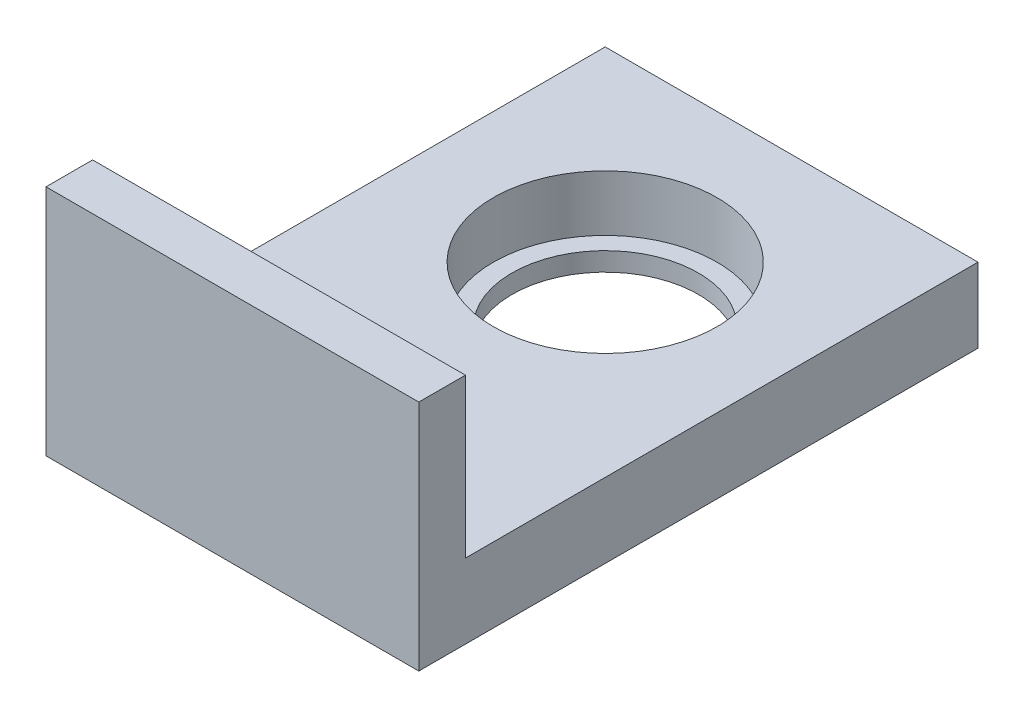
ISO-10303-21;
HEADER;
FILE_DESCRIPTION(('STEP AP214'),'2;1');
FILE_NAME('part.step','',(''),(''),'','','');
FILE_SCHEMA(('AUTOMOTIVE_DESIGN { 1 0 10303 214 1 1 1 1 }'));
ENDSEC;
DATA;
#1=APPLICATION_CONTEXT('core data for automotive mechanical design processes');
#2=APPLICATION_PROTOCOL_DEFINITION('international standard','automotive_design',2000,#1);
#3=PRODUCT_CONTEXT('',#1,'mechanical');
#4=PRODUCT('Part','Part','',(#3));
#5=PRODUCT_RELATED_PRODUCT_CATEGORY('part','',(#4));
#6=PRODUCT_DEFINITION_FORMATION('','',#4);
#7=PRODUCT_DEFINITION_CONTEXT('part definition',#1,'design');
#8=PRODUCT_DEFINITION('design','',#6,#7);
#9=PRODUCT_DEFINITION_SHAPE('','',#8);
#10=(LENGTH_UNIT() NAMED_UNIT(*) SI_UNIT(.MILLI.,.METRE.));
#11=(NAMED_UNIT(*) PLANE_ANGLE_UNIT() SI_UNIT($,.RADIAN.));
#12=(NAMED_UNIT(*) SI_UNIT($,.STERADIAN.) SOLID_ANGLE_UNIT());
#13=UNCERTAINTY_MEASURE_WITH_UNIT(LENGTH_MEASURE(1.E-05),#10,'distance_accuracy_value','');
#14=(GEOMETRIC_REPRESENTATION_CONTEXT(3) GLOBAL_UNCERTAINTY_ASSIGNED_CONTEXT((#13)) GLOBAL_UNIT_ASSIGNED_CONTEXT((#10,
#11,#12)) REPRESENTATION_CONTEXT('',''));
#15=CARTESIAN_POINT('',(0.,0.,0.));
#16=DIRECTION('',(0.,0.,1.));
#17=DIRECTION('',(1.,0.,0.));
#18=AXIS2_PLACEMENT_3D('',#15,#16,#17);
#19=CARTESIAN_POINT('',(40.,8.,0.));
#20=DIRECTION('',(-1.,0.,0.));
#21=DIRECTION('',(0.,0.,1.));
#22=AXIS2_PLACEMENT_3D('',#19,#20,#21);
#23=PLANE('',#22);
#24=DIRECTION('',(0.,0.,-1.));
#25=VECTOR('',#24,1.);
#26=CARTESIAN_POINT('',(40.,0.,0.));
#27=LINE('',#26,#25);
#28=CARTESIAN_POINT('',(40.,0.,5.));
#29=VERTEX_POINT('',#28);
#30=CARTESIAN_POINT('',(40.,0.,-55.));
#31=VERTEX_POINT('',#30);
#32=EDGE_CURVE('E86',#29,#31,#27,.T.);
#33=ORIENTED_EDGE('',*,*,#32,.T.);
#34=DIRECTION('',(0.,-1.,0.));
#35=VECTOR('',#34,1.);
#36=CARTESIAN_POINT('',(40.,8.,-55.));
#37=LINE('',#36,#35);
#38=CARTESIAN_POINT('',(40.,8.,-55.));
#39=VERTEX_POINT('',#38);
#40=EDGE_CURVE('E11',#39,#31,#37,.T.);
#41=ORIENTED_EDGE('',*,*,#40,.F.);
#42=DIRECTION('',(0.,0.,-1.));
#43=VECTOR('',#42,1.);
#44=CARTESIAN_POINT('',(40.,8.,0.));
#45=LINE('',#44,#43);
#46=CARTESIAN_POINT('',(40.,8.,0.));
#47=VERTEX_POINT('',#46);
#48=EDGE_CURVE('E89',#47,#39,#45,.T.);
#49=ORIENTED_EDGE('',*,*,#48,.F.);
#50=DIRECTION('',(0.,-1.,0.));
#51=VECTOR('',#50,1.);
#52=CARTESIAN_POINT('',(40.,25.,0.));
#53=LINE('',#52,#51);
#54=CARTESIAN_POINT('',(40.,25.,0.));
#55=VERTEX_POINT('',#54);
#56=EDGE_CURVE('E77',#55,#47,#53,.T.);
#57=ORIENTED_EDGE('',*,*,#56,.F.);
#58=DIRECTION('',(0.,0.,1.));
#59=VECTOR('',#58,1.);
#60=CARTESIAN_POINT('',(40.,25.,0.));
#61=LINE('',#60,#59);
#62=CARTESIAN_POINT('',(40.,25.,5.));
#63=VERTEX_POINT('',#62);
#64=EDGE_CURVE('E124',#55,#63,#61,.T.);
#65=ORIENTED_EDGE('',*,*,#64,.T.);
#66=DIRECTION('',(0.,-1.,0.));
#67=VECTOR('',#66,1.);
#68=CARTESIAN_POINT('',(40.,25.,5.));
#69=LINE('',#68,#67);
#70=EDGE_CURVE('E135',#63,#29,#69,.T.);
#71=ORIENTED_EDGE('',*,*,#70,.T.);
#72=EDGE_LOOP('',(#33,#41,#49,#57,#65,#71));
#73=FACE_BOUND('',#72,.T.);
#74=ADVANCED_FACE('F35',(#73),#23,.F.);
#75=CARTESIAN_POINT('',(0.,8.,-55.));
#76=DIRECTION('',(0.,0.,-1.));
#77=DIRECTION('',(-1.,0.,0.));
#78=AXIS2_PLACEMENT_3D('',#75,#76,#77);
#79=PLANE('',#78);
#80=DIRECTION('',(1.,0.,0.));
#81=VECTOR('',#80,1.);
#82=CARTESIAN_POINT('',(0.,0.,-55.));
#83=LINE('',#82,#81);
#84=CARTESIAN_POINT('',(0.,0.,-55.));
#85=VERTEX_POINT('',#84);
#86=EDGE_CURVE('E100',#85,#31,#83,.T.);
#87=ORIENTED_EDGE('',*,*,#86,.F.);
#88=DIRECTION('',(0.,-1.,0.));
#89=VECTOR('',#88,1.);
#90=CARTESIAN_POINT('',(0.,8.,-55.));
#91=LINE('',#90,#89);
#92=CARTESIAN_POINT('',(0.,8.,-55.));
#93=VERTEX_POINT('',#92);
#94=EDGE_CURVE('E43',#93,#85,#91,.T.);
#95=ORIENTED_EDGE('',*,*,#94,.F.);
#96=DIRECTION('',(1.,0.,0.));
#97=VECTOR('',#96,1.);
#98=CARTESIAN_POINT('',(0.,8.,-55.));
#99=LINE('',#98,#97);
#100=EDGE_CURVE('E91',#93,#39,#99,.T.);
#101=ORIENTED_EDGE('',*,*,#100,.T.);
#102=ORIENTED_EDGE('',*,*,#40,.T.);
#103=EDGE_LOOP('',(#87,#95,#101,#102));
#104=FACE_BOUND('',#103,.T.);
#105=ADVANCED_FACE('F114',(#104),#79,.T.);
#106=CARTESIAN_POINT('',(0.,8.,0.));
#107=DIRECTION('',(-1.,0.,0.));
#108=DIRECTION('',(0.,0.,1.));
#109=AXIS2_PLACEMENT_3D('',#106,#107,#108);
#110=PLANE('',#109);
#111=DIRECTION('',(0.,0.,-1.));
#112=VECTOR('',#111,1.);
#113=CARTESIAN_POINT('',(0.,0.,0.));
#114=LINE('',#113,#112);
#115=CARTESIAN_POINT('',(0.,0.,5.));
#116=VERTEX_POINT('',#115);
#117=EDGE_CURVE('E97',#116,#85,#114,.T.);
#118=ORIENTED_EDGE('',*,*,#117,.F.);
#119=DIRECTION('',(0.,-1.,0.));
#120=VECTOR('',#119,1.);
#121=CARTESIAN_POINT('',(0.,25.,5.));
#122=LINE('',#121,#120);
#123=CARTESIAN_POINT('',(0.,25.,5.));
#124=VERTEX_POINT('',#123);
#125=EDGE_CURVE('E137',#124,#116,#122,.T.);
#126=ORIENTED_EDGE('',*,*,#125,.F.);
#127=DIRECTION('',(0.,0.,1.));
#128=VECTOR('',#127,1.);
#129=CARTESIAN_POINT('',(0.,25.,0.));
#130=LINE('',#129,#128);
#131=CARTESIAN_POINT('',(0.,25.,0.));
#132=VERTEX_POINT('',#131);
#133=EDGE_CURVE('E141',#132,#124,#130,.T.);
#134=ORIENTED_EDGE('',*,*,#133,.F.);
#135=DIRECTION('',(0.,-1.,0.));
#136=VECTOR('',#135,1.);
#137=CARTESIAN_POINT('',(0.,25.,0.));
#138=LINE('',#137,#136);
#139=CARTESIAN_POINT('',(0.,8.,0.));
#140=VERTEX_POINT('',#139);
#141=EDGE_CURVE('E87',#132,#140,#138,.T.);
#142=ORIENTED_EDGE('',*,*,#141,.T.);
#143=DIRECTION('',(0.,0.,-1.));
#144=VECTOR('',#143,1.);
#145=CARTESIAN_POINT('',(0.,8.,0.));
#146=LINE('',#145,#144);
#147=EDGE_CURVE('E96',#140,#93,#146,.T.);
#148=ORIENTED_EDGE('',*,*,#147,.T.);
#149=ORIENTED_EDGE('',*,*,#94,.T.);
#150=EDGE_LOOP('',(#118,#126,#134,#142,#148,#149));
#151=FACE_BOUND('',#150,.T.);
#152=ADVANCED_FACE('F110',(#151),#110,.T.);
#153=CARTESIAN_POINT('',(0.,8.,0.));
#154=DIRECTION('',(0.,1.,0.));
#155=DIRECTION('',(0.,0.,1.));
#156=AXIS2_PLACEMENT_3D('',#153,#154,#155);
#157=PLANE('',#156);
#158=CARTESIAN_POINT('',(20.,8.,-35.));
#159=DIRECTION('',(0.,1.,0.));
#160=DIRECTION('',(0.,0.,1.));
#161=AXIS2_PLACEMENT_3D('',#158,#159,#160);
#162=CIRCLE('',#161,12.);
#163=CARTESIAN_POINT('',(20.,8.,-23.));
#164=VERTEX_POINT('',#163);
#165=EDGE_CURVE('E129',#164,#164,#162,.T.);
#166=ORIENTED_EDGE('',*,*,#165,.F.);
#167=EDGE_LOOP('',(#166));
#168=FACE_BOUND('',#167,.T.);
#169=DIRECTION('',(1.,0.,0.));
#170=VECTOR('',#169,1.);
#171=CARTESIAN_POINT('',(0.,8.,0.));
#172=LINE('',#171,#170);
#173=EDGE_CURVE('E67',#140,#47,#172,.T.);
#174=ORIENTED_EDGE('',*,*,#173,.T.);
#175=ORIENTED_EDGE('',*,*,#48,.T.);
#176=ORIENTED_EDGE('',*,*,#100,.F.);
#177=ORIENTED_EDGE('',*,*,#147,.F.);
#178=EDGE_LOOP('',(#174,#175,#176,#177));
#179=FACE_BOUND('',#178,.T.);
#180=ADVANCED_FACE('F94',(#168,#179),#157,.T.);
#181=CARTESIAN_POINT('',(0.,0.,0.));
#182=DIRECTION('',(0.,1.,0.));
#183=DIRECTION('',(0.,0.,1.));
#184=AXIS2_PLACEMENT_3D('',#181,#182,#183);
#185=PLANE('',#184);
#186=CARTESIAN_POINT('',(20.,0.,-35.));
#187=DIRECTION('',(0.,1.,0.));
#188=DIRECTION('',(0.,0.,1.));
#189=AXIS2_PLACEMENT_3D('',#186,#187,#188);
#190=CIRCLE('',#189,10.);
#191=CARTESIAN_POINT('',(20.,0.,-25.));
#192=VERTEX_POINT('',#191);
#193=EDGE_CURVE('E177',#192,#192,#190,.T.);
#194=ORIENTED_EDGE('',*,*,#193,.T.);
#195=EDGE_LOOP('',(#194));
#196=FACE_BOUND('',#195,.T.);
#197=ORIENTED_EDGE('',*,*,#32,.F.);
#198=DIRECTION('',(1.,0.,0.));
#199=VECTOR('',#198,1.);
#200=CARTESIAN_POINT('',(0.,0.,5.));
#201=LINE('',#200,#199);
#202=EDGE_CURVE('E120',#116,#29,#201,.T.);
#203=ORIENTED_EDGE('',*,*,#202,.F.);
#204=ORIENTED_EDGE('',*,*,#117,.T.);
#205=ORIENTED_EDGE('',*,*,#86,.T.);
#206=EDGE_LOOP('',(#197,#203,#204,#205));
#207=FACE_BOUND('',#206,.T.);
#208=ADVANCED_FACE('F118',(#196,#207),#185,.F.);
#209=CARTESIAN_POINT('',(0.,25.,0.));
#210=DIRECTION('',(0.,0.,-1.));
#211=DIRECTION('',(-1.,0.,0.));
#212=AXIS2_PLACEMENT_3D('',#209,#210,#211);
#213=PLANE('',#212);
#214=ORIENTED_EDGE('',*,*,#173,.F.);
#215=ORIENTED_EDGE('',*,*,#141,.F.);
#216=DIRECTION('',(1.,0.,0.));
#217=VECTOR('',#216,1.);
#218=CARTESIAN_POINT('',(0.,25.,0.));
#219=LINE('',#218,#217);
#220=EDGE_CURVE('E82',#132,#55,#219,.T.);
#221=ORIENTED_EDGE('',*,*,#220,.T.);
#222=ORIENTED_EDGE('',*,*,#56,.T.);
#223=EDGE_LOOP('',(#214,#215,#221,#222));
#224=FACE_BOUND('',#223,.T.);
#225=ADVANCED_FACE('F79',(#224),#213,.T.);
#226=CARTESIAN_POINT('',(0.,25.,5.));
#227=DIRECTION('',(0.,0.,-1.));
#228=DIRECTION('',(-1.,0.,0.));
#229=AXIS2_PLACEMENT_3D('',#226,#227,#228);
#230=PLANE('',#229);
#231=ORIENTED_EDGE('',*,*,#202,.T.);
#232=ORIENTED_EDGE('',*,*,#70,.F.);
#233=DIRECTION('',(1.,0.,0.));
#234=VECTOR('',#233,1.);
#235=CARTESIAN_POINT('',(0.,25.,5.));
#236=LINE('',#235,#234);
#237=EDGE_CURVE('E133',#124,#63,#236,.T.);
#238=ORIENTED_EDGE('',*,*,#237,.F.);
#239=ORIENTED_EDGE('',*,*,#125,.T.);
#240=EDGE_LOOP('',(#231,#232,#238,#239));
#241=FACE_BOUND('',#240,.T.);
#242=ADVANCED_FACE('F148',(#241),#230,.F.);
#243=CARTESIAN_POINT('',(0.,25.,0.));
#244=DIRECTION('',(0.,1.,0.));
#245=DIRECTION('',(0.,0.,1.));
#246=AXIS2_PLACEMENT_3D('',#243,#244,#245);
#247=PLANE('',#246);
#248=ORIENTED_EDGE('',*,*,#64,.F.);
#249=ORIENTED_EDGE('',*,*,#220,.F.);
#250=ORIENTED_EDGE('',*,*,#133,.T.);
#251=ORIENTED_EDGE('',*,*,#237,.T.);
#252=EDGE_LOOP('',(#248,#249,#250,#251));
#253=FACE_BOUND('',#252,.T.);
#254=ADVANCED_FACE('F146',(#253),#247,.T.);
#255=CARTESIAN_POINT('',(20.,2.,-35.));
#256=DIRECTION('',(0.,1.,0.));
#257=DIRECTION('',(0.,0.,1.));
#258=AXIS2_PLACEMENT_3D('',#255,#256,#257);
#259=CYLINDRICAL_SURFACE('',#258,12.);
#260=CARTESIAN_POINT('',(20.,2.,-35.));
#261=DIRECTION('',(0.,1.,0.));
#262=DIRECTION('',(0.,0.,1.));
#263=AXIS2_PLACEMENT_3D('',#260,#261,#262);
#264=CIRCLE('',#263,12.);
#265=CARTESIAN_POINT('',(20.,2.,-23.));
#266=VERTEX_POINT('',#265);
#267=EDGE_CURVE('E125',#266,#266,#264,.T.);
#268=ORIENTED_EDGE('',*,*,#267,.F.);
#269=EDGE_LOOP('',(#268));
#270=FACE_BOUND('',#269,.T.);
#271=ORIENTED_EDGE('',*,*,#165,.T.);
#272=EDGE_LOOP('',(#271));
#273=FACE_BOUND('',#272,.T.);
#274=ADVANCED_FACE('F155',(#270,#273),#259,.F.);
#275=CARTESIAN_POINT('',(20.,2.,-35.));
#276=DIRECTION('',(0.,1.,0.));
#277=DIRECTION('',(0.,0.,1.));
#278=AXIS2_PLACEMENT_3D('',#275,#276,#277);
#279=PLANE('',#278);
#280=CARTESIAN_POINT('',(20.,2.,-35.));
#281=DIRECTION('',(0.,1.,0.));
#282=DIRECTION('',(0.,0.,1.));
#283=AXIS2_PLACEMENT_3D('',#280,#281,#282);
#284=CIRCLE('',#283,10.);
#285=CARTESIAN_POINT('',(20.,2.,-25.));
#286=VERTEX_POINT('',#285);
#287=EDGE_CURVE('E180',#286,#286,#284,.T.);
#288=ORIENTED_EDGE('',*,*,#287,.F.);
#289=EDGE_LOOP('',(#288));
#290=FACE_BOUND('',#289,.T.);
#291=ORIENTED_EDGE('',*,*,#267,.T.);
#292=EDGE_LOOP('',(#291));
#293=FACE_BOUND('',#292,.T.);
#294=ADVANCED_FACE('F189',(#290,#293),#279,.T.);
#295=CARTESIAN_POINT('',(20.,0.,-35.));
#296=DIRECTION('',(0.,1.,0.));
#297=DIRECTION('',(0.,0.,1.));
#298=AXIS2_PLACEMENT_3D('',#295,#296,#297);
#299=CYLINDRICAL_SURFACE('',#298,10.);
#300=ORIENTED_EDGE('',*,*,#193,.F.);
#301=EDGE_LOOP('',(#300));
#302=FACE_BOUND('',#301,.T.);
#303=ORIENTED_EDGE('',*,*,#287,.T.);
#304=EDGE_LOOP('',(#303));
#305=FACE_BOUND('',#304,.T.);
#306=ADVANCED_FACE('F187',(#302,#305),#299,.F.);
#307=CLOSED_SHELL('',(#74,#105,#152,#180,#208,#225,#242,#254,#274,#294,#306));
#308=MANIFOLD_SOLID_BREP('B2',#307);
#309=ADVANCED_BREP_SHAPE_REPRESENTATION('',(#18,#308),#14);
#310=SHAPE_DEFINITION_REPRESENTATION(#9,#309);
ENDSEC;
END-ISO-10303-21;
